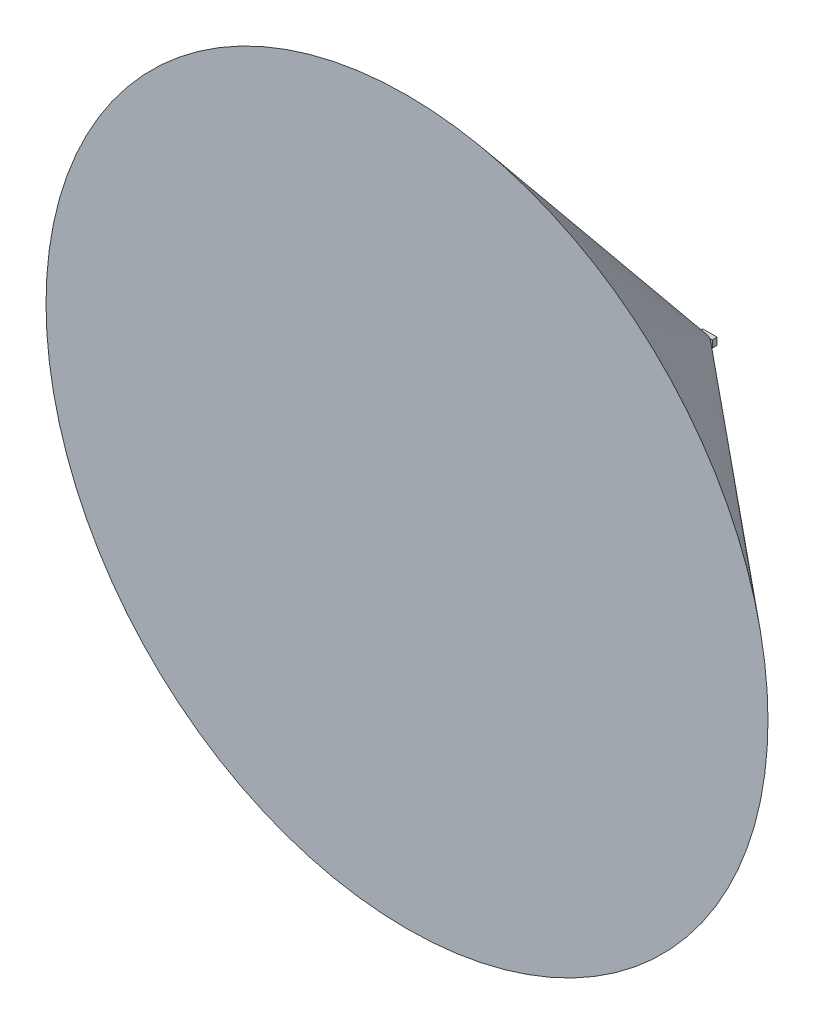
ISO-10303-21;
HEADER;
FILE_DESCRIPTION(('STEP AP214'),'2;1');
FILE_NAME('part.step','',(''),(''),'','','');
FILE_SCHEMA(('AUTOMOTIVE_DESIGN { 1 0 10303 214 1 1 1 1 }'));
ENDSEC;
DATA;
#1=APPLICATION_CONTEXT('core data for automotive mechanical design processes');
#2=APPLICATION_PROTOCOL_DEFINITION('international standard','automotive_design',2000,#1);
#3=PRODUCT_CONTEXT('',#1,'mechanical');
#4=PRODUCT('Part','Part','',(#3));
#5=PRODUCT_RELATED_PRODUCT_CATEGORY('part','',(#4));
#6=PRODUCT_DEFINITION_FORMATION('','',#4);
#7=PRODUCT_DEFINITION_CONTEXT('part definition',#1,'design');
#8=PRODUCT_DEFINITION('design','',#6,#7);
#9=PRODUCT_DEFINITION_SHAPE('','',#8);
#10=(LENGTH_UNIT() NAMED_UNIT(*) SI_UNIT(.MILLI.,.METRE.));
#11=(NAMED_UNIT(*) PLANE_ANGLE_UNIT() SI_UNIT($,.RADIAN.));
#12=(NAMED_UNIT(*) SI_UNIT($,.STERADIAN.) SOLID_ANGLE_UNIT());
#13=UNCERTAINTY_MEASURE_WITH_UNIT(LENGTH_MEASURE(1.E-05),#10,'distance_accuracy_value','');
#14=(GEOMETRIC_REPRESENTATION_CONTEXT(3) GLOBAL_UNCERTAINTY_ASSIGNED_CONTEXT((#13)) GLOBAL_UNIT_ASSIGNED_CONTEXT((#10,
#11,#12)) REPRESENTATION_CONTEXT('',''));
#15=CARTESIAN_POINT('',(0.,0.,0.));
#16=DIRECTION('',(0.,0.,1.));
#17=DIRECTION('',(1.,0.,0.));
#18=AXIS2_PLACEMENT_3D('',#15,#16,#17);
#19=CARTESIAN_POINT('',(19.05,-9.525,12.7));
#20=DIRECTION('',(0.,1.,0.));
#21=DIRECTION('',(-1.,0.,0.));
#22=AXIS2_PLACEMENT_3D('',#19,#20,#21);
#23=PLANE('',#22);
#24=CARTESIAN_POINT('',(-59.2111262841384,-9.52500000000001,50.3227791185919));
#25=CARTESIAN_POINT('',(-57.798130678007,-9.52500000000001,49.1522157168783));
#26=CARTESIAN_POINT('',(-56.3846450170607,-9.52500000000001,47.9822430952561));
#27=CARTESIAN_POINT('',(-53.554458063512,-9.52500000000001,45.6422846138725));
#28=CARTESIAN_POINT('',(-52.1377550091073,-9.52500000000001,44.4723008852144));
#29=CARTESIAN_POINT('',(-49.2738644169754,-9.52500000000001,42.1104987136385));
#30=CARTESIAN_POINT('',(-47.8266435009187,-9.52500000000001,40.9187207281784));
#31=CARTESIAN_POINT('',(-45.6551332887978,-9.52500000000001,39.1338628430146));
#32=CARTESIAN_POINT('',(-44.9316705583681,-9.52500000000001,38.539777296888));
#33=CARTESIAN_POINT('',(-43.4841379845895,-9.52500000000001,37.3524017893801));
#34=CARTESIAN_POINT('',(-42.7600681650686,-9.52500000000001,36.7591117989501));
#35=CARTESIAN_POINT('',(-40.5435245475182,-9.52500000000001,34.9451887422533));
#36=CARTESIAN_POINT('',(-39.0498701214968,-9.52500000000001,33.7259975383783));
#37=CARTESIAN_POINT('',(-36.0580297304135,-9.52500000000001,31.2925789464464));
#38=CARTESIAN_POINT('',(-34.5598429315699,-9.52500000000001,30.0783525822455));
#39=CARTESIAN_POINT('',(-32.303620111569,-9.52500000000001,28.259179818605));
#40=CARTESIAN_POINT('',(-31.5478663411044,-9.52500000000001,27.6514032175941));
#41=CARTESIAN_POINT('',(-30.0344594724018,-9.52500000000001,26.4382200679828));
#42=CARTESIAN_POINT('',(-29.276806376462,-9.52500000000001,25.832813516517));
#43=CARTESIAN_POINT('',(-27.759744700454,-9.52500000000001,24.6254132536541));
#44=CARTESIAN_POINT('',(-27.0003379395113,-9.52500000000001,24.0234172579237));
#45=CARTESIAN_POINT('',(-25.4785980523313,-9.52500000000001,22.8231568662502));
#46=CARTESIAN_POINT('',(-24.7162649717377,-9.525,22.2248924124827));
#47=CARTESIAN_POINT('',(-23.2044125998305,-9.525,21.0460835992658));
#48=CARTESIAN_POINT('',(-22.4549737260954,-9.525,20.4654362280629));
#49=CARTESIAN_POINT('',(-20.9514008626868,-9.525,19.310150864306));
#50=CARTESIAN_POINT('',(-20.197266589686,-9.525,18.7355132401066));
#51=CARTESIAN_POINT('',(-18.6805453964913,-9.525,17.5926243897406));
#52=CARTESIAN_POINT('',(-17.9179397188471,-9.525,17.0243979676637));
#53=CARTESIAN_POINT('',(-16.7677963738534,-9.525,16.1807105222463));
#54=CARTESIAN_POINT('',(-16.3834130169176,-9.525,15.9009496310058));
#55=CARTESIAN_POINT('',(-15.6121570128928,-9.525,15.3448831224064));
#56=CARTESIAN_POINT('',(-15.2252843882852,-9.525,15.0685774739082));
#57=CARTESIAN_POINT('',(-14.4532735749699,-9.525,14.5234496528037));
#58=CARTESIAN_POINT('',(-14.0681707875577,-9.525,14.2545774109422));
#59=CARTESIAN_POINT('',(-13.2945243302776,-9.525,13.7218094555373));
#60=CARTESIAN_POINT('',(-12.9059806151461,-9.525,13.4579138076018));
#61=CARTESIAN_POINT('',(-12.1244102603387,-9.525,12.936044349118));
#62=CARTESIAN_POINT('',(-11.7313798278556,-9.525,12.6780762055666));
#63=CARTESIAN_POINT('',(-10.9403408818977,-9.525,12.1698928702862));
#64=CARTESIAN_POINT('',(-10.5423325377767,-9.525,11.9196774158041));
#65=CARTESIAN_POINT('',(-9.74238255307357,-9.525,11.4304038828352));
#66=CARTESIAN_POINT('',(-9.34047285073558,-9.525,11.191293790989));
#67=CARTESIAN_POINT('',(-8.52930843774018,-9.525,10.7256220808828));
#68=CARTESIAN_POINT('',(-8.12005247764364,-9.525,10.4990626245076));
#69=CARTESIAN_POINT('',(-7.29348543299187,-9.525,10.0628106152164));
#70=CARTESIAN_POINT('',(-6.87618915562599,-9.525,9.85309016140765));
#71=CARTESIAN_POINT('',(-6.03138874872098,-9.525,9.4554669377871));
#72=CARTESIAN_POINT('',(-5.60388990947327,-9.525,9.26755314478225));
#73=CARTESIAN_POINT('',(-5.07873069318713,-9.525,9.05732703317884));
#74=CARTESIAN_POINT('',(-4.98655392643024,-9.525,9.02118323941209));
#75=CARTESIAN_POINT('',(-4.80165129108654,-9.525,8.95027532813555));
#76=CARTESIAN_POINT('',(-4.70892533077992,-9.525,8.9155114490027));
#77=CARTESIAN_POINT('',(-4.52290903820565,-9.525,8.84744225026026));
#78=CARTESIAN_POINT('',(-4.42961855205957,-9.525,8.81413735079453));
#79=CARTESIAN_POINT('',(-4.24250097578107,-9.525,8.7490850134668));
#80=CARTESIAN_POINT('',(-4.14867390588516,-9.525,8.71733751729641));
#81=CARTESIAN_POINT('',(-3.86645903140114,-9.525,8.62458799987588));
#82=CARTESIAN_POINT('',(-3.67725294046468,-9.525,8.5660478229745));
#83=CARTESIAN_POINT('',(-3.296730632139,-9.525,8.45628200069581));
#84=CARTESIAN_POINT('',(-3.10541446817722,-9.525,8.4050561705738));
#85=CARTESIAN_POINT('',(-2.72536288584043,-9.525,8.31178912034752));
#86=CARTESIAN_POINT('',(-2.53667414628418,-9.525,8.26955860093942));
#87=CARTESIAN_POINT('',(-2.15761527585595,-9.525,8.19345755027757));
#88=CARTESIAN_POINT('',(-1.96724519352046,-9.525,8.15958677850893));
#89=CARTESIAN_POINT('',(-1.58502886432571,-9.525,8.10079476350435));
#90=CARTESIAN_POINT('',(-1.39318196804172,-9.525,8.07587771797159));
#91=CARTESIAN_POINT('',(-1.00849586805919,-9.525,8.03550289220054));
#92=CARTESIAN_POINT('',(-0.815656695492749,-9.525,8.02004481699524));
#93=CARTESIAN_POINT('',(-0.425792895339982,-9.525,7.99870963764979));
#94=CARTESIAN_POINT('',(-0.228757974169955,-9.525,7.9930188976519));
#95=CARTESIAN_POINT('',(0.165339012858012,-9.525,7.99191765422109));
#96=CARTESIAN_POINT('',(0.362401078633483,-9.525,7.99650712021564));
#97=CARTESIAN_POINT('',(0.755961435402333,-9.525,8.0158628566554));
#98=CARTESIAN_POINT('',(0.95245988703034,-9.525,8.03062586060924));
#99=CARTESIAN_POINT('',(1.3444765098343,-9.525,8.06999758890299));
#100=CARTESIAN_POINT('',(1.53999454166912,-9.525,8.09460767471827));
#101=CARTESIAN_POINT('',(2.12722465693156,-9.525,8.18291984620323));
#102=CARTESIAN_POINT('',(2.51684205529649,-9.525,8.26095697978292));
#103=CARTESIAN_POINT('',(3.28800819008389,-9.525,8.44953439108731));
#104=CARTESIAN_POINT('',(3.66955439909583,-9.525,8.56008469308728));
#105=CARTESIAN_POINT('',(4.47202634358249,-9.525,8.82337552675518));
#106=CARTESIAN_POINT('',(4.89176310694337,-9.525,8.97969995311876));
#107=CARTESIAN_POINT('',(5.72076675296057,-9.525,9.31821942028616));
#108=CARTESIAN_POINT('',(6.13002756609517,-9.525,9.50042907514941));
#109=CARTESIAN_POINT('',(6.93991919741196,-9.525,9.88487926812466));
#110=CARTESIAN_POINT('',(7.3405316021264,-9.525,10.087158227942));
#111=CARTESIAN_POINT('',(8.13364149636261,-9.525,10.5067560519127));
#112=CARTESIAN_POINT('',(8.52614050828218,-9.525,10.7240720606243));
#113=CARTESIAN_POINT('',(9.30793126433211,-9.525,11.1723547678221));
#114=CARTESIAN_POINT('',(9.69716232331918,-9.525,11.4034267458107));
#115=CARTESIAN_POINT('',(10.4699688843146,-9.525,11.8748316239032));
#116=CARTESIAN_POINT('',(10.8535442010776,-9.525,12.1151648264173));
#117=CARTESIAN_POINT('',(11.6154939051243,-9.525,12.6028385447178));
#118=CARTESIAN_POINT('',(11.9938744475744,-9.525,12.8501694681199));
#119=CARTESIAN_POINT('',(12.5585021816909,-9.525,13.2255642782722));
#120=CARTESIAN_POINT('',(12.7462187114276,-9.525,13.3514274386007));
#121=CARTESIAN_POINT('',(13.1207547052055,-9.525,13.6044808984173));
#122=CARTESIAN_POINT('',(13.3075741711645,-9.525,13.7316711950662));
#123=CARTESIAN_POINT('',(13.9260010906962,-9.525,14.1556119993781));
#124=CARTESIAN_POINT('',(14.3558213404271,-9.525,14.4549716878554));
#125=CARTESIAN_POINT('',(15.2118601648683,-9.525,15.058803222371));
#126=CARTESIAN_POINT('',(15.6380786579664,-9.525,15.3632751837839));
#127=CARTESIAN_POINT('',(16.4875569269843,-9.525,15.9763823118836));
#128=CARTESIAN_POINT('',(16.910816476432,-9.525,16.2850177920549));
#129=CARTESIAN_POINT('',(17.7548338132205,-9.525,16.9056931194831));
#130=CARTESIAN_POINT('',(18.1755915811001,-9.525,17.217732993169));
#131=CARTESIAN_POINT('',(19.4349405602011,-9.525,18.1582267465879));
#132=CARTESIAN_POINT('',(20.2703852589862,-9.525,18.7908934104401));
#133=CARTESIAN_POINT('',(21.9352014108484,-9.525,20.0641678937604));
#134=CARTESIAN_POINT('',(22.7645727754719,-9.525,20.704775828523));
#135=CARTESIAN_POINT('',(24.0056774808653,-9.525,21.6704579600574));
#136=CARTESIAN_POINT('',(24.41912385122,-9.525,21.9933340530478));
#137=CARTESIAN_POINT('',(25.2450084522166,-9.525,22.6403664502462));
#138=CARTESIAN_POINT('',(25.6574466906518,-9.525,22.964522744507));
#139=CARTESIAN_POINT('',(26.8934564979113,-9.525,23.9386678898217));
#140=CARTESIAN_POINT('',(27.71571316439,-9.525,24.5903252136408));
#141=CARTESIAN_POINT('',(29.3573477342712,-9.525,25.896959975562));
#142=CARTESIAN_POINT('',(30.1767261136396,-9.525,26.5519368162951));
#143=CARTESIAN_POINT('',(31.8133051143811,-9.525,27.8646056882598));
#144=CARTESIAN_POINT('',(32.6305057343293,-9.525,28.522297721267));
#145=CARTESIAN_POINT('',(34.2585151114168,-9.525,29.836123126818));
#146=CARTESIAN_POINT('',(35.0693338254447,-9.525,30.4922441664984));
#147=CARTESIAN_POINT('',(36.68954208455,-9.525,31.8062487966064));
#148=CARTESIAN_POINT('',(37.4989316288521,-9.525,32.4641323879898));
#149=CARTESIAN_POINT('',(39.925401745075,-9.52499999999999,34.4400076036152));
#150=CARTESIAN_POINT('',(41.5407156998627,-9.525,35.7601686189558));
#151=CARTESIAN_POINT('',(44.7672882324955,-9.525,38.4039647057314));
#152=CARTESIAN_POINT('',(46.378548300614,-9.525,39.7275979599945));
#153=CARTESIAN_POINT('',(49.59859401347,-9.525,42.3778372226207));
#154=CARTESIAN_POINT('',(51.2073796830087,-9.52499999999999,43.7044432008562));
#155=CARTESIAN_POINT('',(53.3482438583699,-9.52499999999999,45.4723248848185));
#156=CARTESIAN_POINT('',(53.8811513191466,-9.52499999999999,45.9125973076647));
#157=CARTESIAN_POINT('',(54.9468057128318,-9.52499999999999,46.793394497836));
#158=CARTESIAN_POINT('',(55.4795526356174,-9.52499999999999,47.2339192774102));
#159=CARTESIAN_POINT('',(56.5455442469471,-9.52499999999999,48.1157333198826));
#160=CARTESIAN_POINT('',(57.0787887171165,-9.52499999999999,48.5570228467465));
#161=CARTESIAN_POINT('',(58.145088690378,-9.52499999999999,49.4397717532929));
#162=CARTESIAN_POINT('',(58.6781442020947,-9.52499999999999,49.8812311225574));
#163=CARTESIAN_POINT('',(59.2111262841384,-9.52499999999999,50.3227791185919));
#164=B_SPLINE_CURVE_WITH_KNOTS('',3,(#24,#25,#26,#27,#28,#29,#30,#31,#32,#33,#34,#35,#36,#37,
#38,#39,#40,#41,#42,#43,#44,#45,#46,#47,#48,#49,#50,#51,#52,#53,#54,#55,#56,#57,#58,#59,#60,#61,
#62,#63,#64,#65,#66,#67,#68,#69,#70,#71,#72,#73,#74,#75,#76,#77,#78,#79,#80,#81,#82,#83,#84,#85,
#86,#87,#88,#89,#90,#91,#92,#93,#94,#95,#96,#97,#98,#99,#100,#101,#102,#103,#104,#105,#106,#107,
#108,#109,#110,#111,#112,#113,#114,#115,#116,#117,#118,#119,#120,#121,#122,#123,#124,#125,#126,
#127,#128,#129,#130,#131,#132,#133,#134,#135,#136,#137,#138,#139,#140,#141,#142,#143,#144,#145,
#146,#147,#148,#149,#150,#151,#152,#153,#154,#155,#156,#157,#158,#159,#160,#161,#162,#163),
.UNSPECIFIED.,.F.,.F.,(4,2,2,2,2,2,2,2,2,2,2,2,2,2,2,2,2,2,2,2,2,2,2,2,2,2,2,2,2,2,2,2,2,2,2,2,
2,2,2,2,2,2,2,2,2,2,2,2,2,2,2,2,2,2,2,2,2,2,2,2,2,2,2,2,2,2,2,2,2,4),(0.,5.50463288732469,
11.0167261942872,16.6410498544287,19.4494339150643,22.257712475265,28.0418969300579,
33.8272194547593,36.7366840584958,39.6461451436184,42.553347862425,45.4605054184399,
48.3046491718042,51.1489662411247,54.001952728554,55.4281743999486,56.8543832087093,
58.2633824721277,59.6724002978331,61.0827134402983,62.4929787322307,63.8957848982212,
65.2988319551983,66.6995041240066,68.0994651448253,68.3964870151909,68.6935599740297,
68.9907179263356,69.287864744695,69.881888028169,70.4758963052353,71.0557916604281,
71.6356703297429,72.2158205052931,72.7959525886115,73.3870355857547,73.9781168250657,
74.5690083700202,75.1599816409555,76.3502153648191,77.5408164401666,78.8833701506339,
80.2266848631984,81.5726228174155,82.9183058841497,84.2761036762021,85.6339458425559,
86.9900091701999,87.6680248037928,88.3460389872049,89.9173724190544,91.4887413608658,
93.0602292838488,94.6317294153324,97.7755533776241,100.919423036745,102.493168548294,
104.066901855614,107.214406484139,110.36136350056,113.508322575338,116.637424320717,
119.766527763252,126.024997351609,132.280668746854,138.536277026758,140.610034835427,
142.683903679822,144.760385035418,146.836754650979),.UNSPECIFIED.);
#165=CARTESIAN_POINT('',(-11.7622613438332,-9.525,12.7));
#166=VERTEX_POINT('',#165);
#167=CARTESIAN_POINT('',(11.7622613438332,-9.525,12.7));
#168=VERTEX_POINT('',#167);
#169=EDGE_CURVE('E123',#166,#168,#164,.T.);
#170=ORIENTED_EDGE('',*,*,#169,.F.);
#171=DIRECTION('',(1.,0.,0.));
#172=VECTOR('',#171,1.);
#173=CARTESIAN_POINT('',(19.05,-9.525,12.7));
#174=LINE('',#173,#172);
#175=CARTESIAN_POINT('',(-19.05,-9.525,12.7));
#176=VERTEX_POINT('',#175);
#177=EDGE_CURVE('E109',#176,#166,#174,.T.);
#178=ORIENTED_EDGE('',*,*,#177,.F.);
#179=DIRECTION('',(0.,0.,-1.));
#180=VECTOR('',#179,1.);
#181=CARTESIAN_POINT('',(-19.05,-9.525,12.7));
#182=LINE('',#181,#180);
#183=CARTESIAN_POINT('',(-19.05,-9.525,0.));
#184=VERTEX_POINT('',#183);
#185=EDGE_CURVE('E133',#176,#184,#182,.T.);
#186=ORIENTED_EDGE('',*,*,#185,.T.);
#187=DIRECTION('',(1.,0.,0.));
#188=VECTOR('',#187,1.);
#189=CARTESIAN_POINT('',(19.05,-9.525,0.));
#190=LINE('',#189,#188);
#191=CARTESIAN_POINT('',(19.05,-9.525,0.));
#192=VERTEX_POINT('',#191);
#193=EDGE_CURVE('E156',#184,#192,#190,.T.);
#194=ORIENTED_EDGE('',*,*,#193,.T.);
#195=DIRECTION('',(0.,0.,-1.));
#196=VECTOR('',#195,1.);
#197=CARTESIAN_POINT('',(19.05,-9.525,12.7));
#198=LINE('',#197,#196);
#199=CARTESIAN_POINT('',(19.05,-9.525,12.7));
#200=VERTEX_POINT('',#199);
#201=EDGE_CURVE('E135',#200,#192,#198,.T.);
#202=ORIENTED_EDGE('',*,*,#201,.F.);
#203=EDGE_CURVE('E119',#168,#200,#174,.T.);
#204=ORIENTED_EDGE('',*,*,#203,.F.);
#205=EDGE_LOOP('',(#170,#178,#186,#194,#202,#204));
#206=FACE_BOUND('',#205,.T.);
#207=ADVANCED_FACE('F45',(#206),#23,.F.);
#208=CARTESIAN_POINT('',(19.05,9.525,12.7));
#209=DIRECTION('',(0.,-1.,0.));
#210=DIRECTION('',(1.,0.,0.));
#211=AXIS2_PLACEMENT_3D('',#208,#209,#210);
#212=PLANE('',#211);
#213=CARTESIAN_POINT('',(59.2111262841384,9.52500000000001,50.3227791185919));
#214=CARTESIAN_POINT('',(57.798130678007,9.52500000000001,49.1522157168783));
#215=CARTESIAN_POINT('',(56.3846450170607,9.52500000000001,47.9822430952561));
#216=CARTESIAN_POINT('',(53.554458063512,9.52500000000001,45.6422846138725));
#217=CARTESIAN_POINT('',(52.1377550091073,9.52500000000001,44.4723008852144));
#218=CARTESIAN_POINT('',(49.2738644169754,9.52500000000001,42.1104987136385));
#219=CARTESIAN_POINT('',(47.8266435009187,9.52500000000001,40.9187207281785));
#220=CARTESIAN_POINT('',(45.6551332887978,9.52500000000001,39.1338628430146));
#221=CARTESIAN_POINT('',(44.9316705583681,9.52500000000001,38.539777296888));
#222=CARTESIAN_POINT('',(43.4841379845896,9.52500000000001,37.3524017893802));
#223=CARTESIAN_POINT('',(42.7600681650687,9.52500000000001,36.7591117989501));
#224=CARTESIAN_POINT('',(40.5435245475183,9.52500000000001,34.9451887422533));
#225=CARTESIAN_POINT('',(39.0498701214969,9.525,33.7259975383784));
#226=CARTESIAN_POINT('',(36.0580297304136,9.525,31.2925789464464));
#227=CARTESIAN_POINT('',(34.5598429315699,9.525,30.0783525822455));
#228=CARTESIAN_POINT('',(32.3036201115691,9.525,28.259179818605));
#229=CARTESIAN_POINT('',(31.5478663411045,9.525,27.6514032175942));
#230=CARTESIAN_POINT('',(30.0344594724019,9.525,26.4382200679828));
#231=CARTESIAN_POINT('',(29.2768063764621,9.525,25.832813516517));
#232=CARTESIAN_POINT('',(27.759744700454,9.525,24.6254132536542));
#233=CARTESIAN_POINT('',(27.0003379395113,9.525,24.0234172579238));
#234=CARTESIAN_POINT('',(25.4785980523313,9.525,22.8231568662502));
#235=CARTESIAN_POINT('',(24.7162649717378,9.525,22.2248924124828));
#236=CARTESIAN_POINT('',(23.2044125998306,9.525,21.0460835992658));
#237=CARTESIAN_POINT('',(22.4549737260955,9.525,20.4654362280629));
#238=CARTESIAN_POINT('',(20.9514008626868,9.525,19.310150864306));
#239=CARTESIAN_POINT('',(20.1972665896861,9.525,18.7355132401067));
#240=CARTESIAN_POINT('',(18.6805453964913,9.525,17.5926243897407));
#241=CARTESIAN_POINT('',(17.9179397188471,9.525,17.0243979676637));
#242=CARTESIAN_POINT('',(16.7677963738534,9.525,16.1807105222463));
#243=CARTESIAN_POINT('',(16.3834130169176,9.525,15.9009496310059));
#244=CARTESIAN_POINT('',(15.6121570128928,9.525,15.3448831224065));
#245=CARTESIAN_POINT('',(15.2252843882852,9.525,15.0685774739082));
#246=CARTESIAN_POINT('',(14.4532735749699,9.525,14.5234496528037));
#247=CARTESIAN_POINT('',(14.0681707875577,9.525,14.2545774109422));
#248=CARTESIAN_POINT('',(13.2945243302776,9.525,13.7218094555373));
#249=CARTESIAN_POINT('',(12.9059806151461,9.525,13.4579138076018));
#250=CARTESIAN_POINT('',(12.1244102603387,9.525,12.936044349118));
#251=CARTESIAN_POINT('',(11.7313798278556,9.525,12.6780762055667));
#252=CARTESIAN_POINT('',(10.9403408818977,9.525,12.1698928702862));
#253=CARTESIAN_POINT('',(10.5423325377767,9.525,11.9196774158041));
#254=CARTESIAN_POINT('',(9.74238255307359,9.525,11.4304038828352));
#255=CARTESIAN_POINT('',(9.34047285073561,9.525,11.191293790989));
#256=CARTESIAN_POINT('',(8.5293084377402,9.525,10.7256220808828));
#257=CARTESIAN_POINT('',(8.12005247764365,9.525,10.4990626245076));
#258=CARTESIAN_POINT('',(7.29348543299189,9.525,10.0628106152164));
#259=CARTESIAN_POINT('',(6.87618915562601,9.525,9.85309016140766));
#260=CARTESIAN_POINT('',(6.03138874872099,9.525,9.45546693778711));
#261=CARTESIAN_POINT('',(5.60388990947329,9.525,9.26755314478226));
#262=CARTESIAN_POINT('',(5.07873069318715,9.525,9.05732703317885));
#263=CARTESIAN_POINT('',(4.98655392643026,9.525,9.02118323941209));
#264=CARTESIAN_POINT('',(4.80165129108656,9.525,8.95027532813556));
#265=CARTESIAN_POINT('',(4.70892533077994,9.525,8.91551144900271));
#266=CARTESIAN_POINT('',(4.52290903820567,9.525,8.84744225026026));
#267=CARTESIAN_POINT('',(4.42961855205958,9.525,8.81413735079453));
#268=CARTESIAN_POINT('',(4.24250097578109,9.525,8.7490850134668));
#269=CARTESIAN_POINT('',(4.14867390588518,9.525,8.71733751729642));
#270=CARTESIAN_POINT('',(3.86645903140115,9.525,8.62458799987588));
#271=CARTESIAN_POINT('',(3.6772529404647,9.525,8.5660478229745));
#272=CARTESIAN_POINT('',(3.29673063213902,9.525,8.45628200069581));
#273=CARTESIAN_POINT('',(3.10541446817724,9.525,8.40505617057381));
#274=CARTESIAN_POINT('',(2.72536288584044,9.525,8.31178912034753));
#275=CARTESIAN_POINT('',(2.5366741462842,9.525,8.26955860093942));
#276=CARTESIAN_POINT('',(2.15761527585597,9.525,8.19345755027757));
#277=CARTESIAN_POINT('',(1.96724519352047,9.525,8.15958677850893));
#278=CARTESIAN_POINT('',(1.58502886432572,9.525,8.10079476350435));
#279=CARTESIAN_POINT('',(1.39318196804174,9.525,8.07587771797159));
#280=CARTESIAN_POINT('',(1.00849586805921,9.525,8.03550289220054));
#281=CARTESIAN_POINT('',(0.815656695492771,9.525,8.02004481699524));
#282=CARTESIAN_POINT('',(0.425792895340004,9.525,7.99870963764979));
#283=CARTESIAN_POINT('',(0.228757974169976,9.525,7.9930188976519));
#284=CARTESIAN_POINT('',(-0.165339012857993,9.525,7.99191765422108));
#285=CARTESIAN_POINT('',(-0.362401078633465,9.525,7.99650712021563));
#286=CARTESIAN_POINT('',(-0.75596143540231,9.525,8.0158628566554));
#287=CARTESIAN_POINT('',(-0.952459887030311,9.525,8.03062586060924));
#288=CARTESIAN_POINT('',(-1.34447650983427,9.525,8.06999758890299));
#289=CARTESIAN_POINT('',(-1.53999454166909,9.525,8.09460767471826));
#290=CARTESIAN_POINT('',(-2.12722465693153,9.525,8.18291984620323));
#291=CARTESIAN_POINT('',(-2.51684205529646,9.525,8.26095697978291));
#292=CARTESIAN_POINT('',(-3.28800819008386,9.525,8.4495343910873));
#293=CARTESIAN_POINT('',(-3.66955439909581,9.525,8.56008469308727));
#294=CARTESIAN_POINT('',(-4.47202634358246,9.525,8.82337552675517));
#295=CARTESIAN_POINT('',(-4.89176310694334,9.525,8.97969995311875));
#296=CARTESIAN_POINT('',(-5.72076675296053,9.525,9.31821942028614));
#297=CARTESIAN_POINT('',(-6.13002756609513,9.525,9.50042907514939));
#298=CARTESIAN_POINT('',(-6.93991919741191,9.525,9.88487926812463));
#299=CARTESIAN_POINT('',(-7.34053160212635,9.525,10.087158227942));
#300=CARTESIAN_POINT('',(-8.13364149636254,9.525,10.5067560519126));
#301=CARTESIAN_POINT('',(-8.52614050828212,9.525,10.7240720606243));
#302=CARTESIAN_POINT('',(-9.30793126433204,9.525,11.1723547678221));
#303=CARTESIAN_POINT('',(-9.69716232331911,9.525,11.4034267458107));
#304=CARTESIAN_POINT('',(-10.4699688843146,9.525,11.8748316239032));
#305=CARTESIAN_POINT('',(-10.8535442010775,9.525,12.1151648264172));
#306=CARTESIAN_POINT('',(-11.6154939051242,9.525,12.6028385447178));
#307=CARTESIAN_POINT('',(-11.9938744475744,9.525,12.8501694681198));
#308=CARTESIAN_POINT('',(-12.5585021816908,9.525,13.2255642782721));
#309=CARTESIAN_POINT('',(-12.7462187114275,9.525,13.3514274386007));
#310=CARTESIAN_POINT('',(-13.1207547052054,9.525,13.6044808984172));
#311=CARTESIAN_POINT('',(-13.3075741711644,9.525,13.7316711950661));
#312=CARTESIAN_POINT('',(-13.9260010906961,9.525,14.1556119993781));
#313=CARTESIAN_POINT('',(-14.355821340427,9.525,14.4549716878554));
#314=CARTESIAN_POINT('',(-15.2118601648682,9.525,15.0588032223709));
#315=CARTESIAN_POINT('',(-15.6380786579662,9.525,15.3632751837839));
#316=CARTESIAN_POINT('',(-16.4875569269842,9.525,15.9763823118835));
#317=CARTESIAN_POINT('',(-16.9108164764319,9.525,16.2850177920548));
#318=CARTESIAN_POINT('',(-17.7548338132203,9.525,16.905693119483));
#319=CARTESIAN_POINT('',(-18.1755915810999,9.525,17.2177329931689));
#320=CARTESIAN_POINT('',(-19.4349405602009,9.525,18.1582267465878));
#321=CARTESIAN_POINT('',(-20.270385258986,9.525,18.79089341044));
#322=CARTESIAN_POINT('',(-21.9352014108482,9.525,20.0641678937603));
#323=CARTESIAN_POINT('',(-22.7645727754717,9.525,20.7047758285229));
#324=CARTESIAN_POINT('',(-24.0056774808651,9.525,21.6704579600572));
#325=CARTESIAN_POINT('',(-24.4191238512198,9.525,21.9933340530476));
#326=CARTESIAN_POINT('',(-25.2450084522164,9.525,22.6403664502461));
#327=CARTESIAN_POINT('',(-25.6574466906515,9.525,22.9645227445069));
#328=CARTESIAN_POINT('',(-26.8934564979111,9.52499999999999,23.9386678898215));
#329=CARTESIAN_POINT('',(-27.7157131643897,9.525,24.5903252136406));
#330=CARTESIAN_POINT('',(-29.3573477342709,9.525,25.8969599755618));
#331=CARTESIAN_POINT('',(-30.1767261136393,9.525,26.5519368162949));
#332=CARTESIAN_POINT('',(-31.8133051143808,9.525,27.8646056882596));
#333=CARTESIAN_POINT('',(-32.630505734329,9.525,28.5222977212668));
#334=CARTESIAN_POINT('',(-34.2585151114165,9.525,29.8361231268177));
#335=CARTESIAN_POINT('',(-35.0693338254444,9.525,30.4922441664982));
#336=CARTESIAN_POINT('',(-36.6895420845497,9.525,31.8062487966061));
#337=CARTESIAN_POINT('',(-37.4989316288518,9.52499999999999,32.4641323879895));
#338=CARTESIAN_POINT('',(-39.9254017450746,9.52499999999999,34.4400076036149));
#339=CARTESIAN_POINT('',(-41.5407156998623,9.52499999999999,35.7601686189555));
#340=CARTESIAN_POINT('',(-44.767288232495,9.52499999999999,38.4039647057311));
#341=CARTESIAN_POINT('',(-46.3785483006135,9.52499999999999,39.7275979599941));
#342=CARTESIAN_POINT('',(-49.5985940134695,9.52499999999999,42.3778372226203));
#343=CARTESIAN_POINT('',(-51.2073796830083,9.52499999999999,43.7044432008557));
#344=CARTESIAN_POINT('',(-53.3482438583694,9.52499999999999,45.4723248848181));
#345=CARTESIAN_POINT('',(-53.8811513191461,9.52499999999999,45.9125973076643));
#346=CARTESIAN_POINT('',(-54.9468057128314,9.52499999999999,46.7933944978357));
#347=CARTESIAN_POINT('',(-55.4795526356171,9.52499999999999,47.23391927741));
#348=CARTESIAN_POINT('',(-56.5455442469469,9.52499999999999,48.1157333198824));
#349=CARTESIAN_POINT('',(-57.0787887171163,9.52499999999999,48.5570228467463));
#350=CARTESIAN_POINT('',(-58.1450886903779,9.52499999999999,49.4397717532929));
#351=CARTESIAN_POINT('',(-58.6781442020946,9.52499999999999,49.8812311225574));
#352=CARTESIAN_POINT('',(-59.2111262841384,9.52499999999999,50.3227791185919));
#353=B_SPLINE_CURVE_WITH_KNOTS('',3,(#213,#214,#215,#216,#217,#218,#219,#220,#221,#222,#223,
#224,#225,#226,#227,#228,#229,#230,#231,#232,#233,#234,#235,#236,#237,#238,#239,#240,#241,#242,
#243,#244,#245,#246,#247,#248,#249,#250,#251,#252,#253,#254,#255,#256,#257,#258,#259,#260,#261,
#262,#263,#264,#265,#266,#267,#268,#269,#270,#271,#272,#273,#274,#275,#276,#277,#278,#279,#280,
#281,#282,#283,#284,#285,#286,#287,#288,#289,#290,#291,#292,#293,#294,#295,#296,#297,#298,#299,
#300,#301,#302,#303,#304,#305,#306,#307,#308,#309,#310,#311,#312,#313,#314,#315,#316,#317,#318,
#319,#320,#321,#322,#323,#324,#325,#326,#327,#328,#329,#330,#331,#332,#333,#334,#335,#336,#337,
#338,#339,#340,#341,#342,#343,#344,#345,#346,#347,#348,#349,#350,#351,#352),.UNSPECIFIED.,.F.,
.F.,(4,2,2,2,2,2,2,2,2,2,2,2,2,2,2,2,2,2,2,2,2,2,2,2,2,2,2,2,2,2,2,2,2,2,2,2,2,2,2,2,2,2,2,2,2,
2,2,2,2,2,2,2,2,2,2,2,2,2,2,2,2,2,2,2,2,2,2,2,2,4),(0.,5.50463288732465,11.0167261942872,
16.6410498544286,19.4494339150642,22.2577124752648,28.0418969300578,33.8272194547592,
36.7366840584957,39.6461451436183,42.5533478624249,45.4605054184398,48.3046491718041,
51.1489662411246,54.0019527285539,55.4281743999486,56.8543832087093,58.2633824721277,
59.672400297833,61.0827134402983,62.4929787322307,63.8957848982211,65.2988319551982,
66.6995041240065,68.0994651448252,68.3964870151908,68.6935599740296,68.9907179263356,
69.2878647446949,69.8818880281689,70.4758963052353,71.0557916604281,71.6356703297428,
72.215820505293,72.7959525886114,73.3870355857546,73.9781168250656,74.5690083700201,
75.1599816409554,76.3502153648191,77.5408164401666,78.8833701506338,80.2266848631983,
81.5726228174154,82.9183058841495,84.276103676202,85.6339458425557,86.9900091701998,
87.6680248037927,88.3460389872047,89.9173724190542,91.4887413608656,93.0602292838486,
94.6317294153322,97.7755533776239,100.919423036745,102.493168548294,104.066901855614,
107.214406484138,110.36136350056,113.508322575338,116.637424320717,119.766527763252,
126.024997351608,132.280668746853,138.536277026757,140.610034835426,142.683903679821,
144.760385035418,146.836754650979),.UNSPECIFIED.);
#354=CARTESIAN_POINT('',(11.7622613438332,9.525,12.7));
#355=VERTEX_POINT('',#354);
#356=CARTESIAN_POINT('',(-11.7622613438332,9.525,12.7));
#357=VERTEX_POINT('',#356);
#358=EDGE_CURVE('E128',#355,#357,#353,.T.);
#359=ORIENTED_EDGE('',*,*,#358,.F.);
#360=DIRECTION('',(-1.,0.,0.));
#361=VECTOR('',#360,1.);
#362=CARTESIAN_POINT('',(19.05,9.525,12.7));
#363=LINE('',#362,#361);
#364=CARTESIAN_POINT('',(19.05,9.525,12.7));
#365=VERTEX_POINT('',#364);
#366=EDGE_CURVE('E149',#365,#355,#363,.T.);
#367=ORIENTED_EDGE('',*,*,#366,.F.);
#368=DIRECTION('',(0.,0.,-1.));
#369=VECTOR('',#368,1.);
#370=CARTESIAN_POINT('',(19.05,9.525,12.7));
#371=LINE('',#370,#369);
#372=CARTESIAN_POINT('',(19.05,9.525,0.));
#373=VERTEX_POINT('',#372);
#374=EDGE_CURVE('E139',#365,#373,#371,.T.);
#375=ORIENTED_EDGE('',*,*,#374,.T.);
#376=DIRECTION('',(-1.,0.,0.));
#377=VECTOR('',#376,1.);
#378=CARTESIAN_POINT('',(19.05,9.525,0.));
#379=LINE('',#378,#377);
#380=CARTESIAN_POINT('',(-19.05,9.525,0.));
#381=VERTEX_POINT('',#380);
#382=EDGE_CURVE('E150',#373,#381,#379,.T.);
#383=ORIENTED_EDGE('',*,*,#382,.T.);
#384=DIRECTION('',(0.,0.,-1.));
#385=VECTOR('',#384,1.);
#386=CARTESIAN_POINT('',(-19.05,9.525,12.7));
#387=LINE('',#386,#385);
#388=CARTESIAN_POINT('',(-19.05,9.525,12.7));
#389=VERTEX_POINT('',#388);
#390=EDGE_CURVE('E145',#389,#381,#387,.T.);
#391=ORIENTED_EDGE('',*,*,#390,.F.);
#392=EDGE_CURVE('E164',#357,#389,#363,.T.);
#393=ORIENTED_EDGE('',*,*,#392,.F.);
#394=EDGE_LOOP('',(#359,#367,#375,#383,#391,#393));
#395=FACE_BOUND('',#394,.T.);
#396=ADVANCED_FACE('F197',(#395),#212,.F.);
#397=CARTESIAN_POINT('',(0.,0.,12.7));
#398=DIRECTION('',(0.,0.,-1.));
#399=DIRECTION('',(-1.,0.,0.));
#400=AXIS2_PLACEMENT_3D('',#397,#398,#399);
#401=PLANE('',#400);
#402=CARTESIAN_POINT('',(0.,0.,12.7));
#403=DIRECTION('',(0.,0.,-1.));
#404=DIRECTION('',(-1.,0.,0.));
#405=AXIS2_PLACEMENT_3D('',#402,#403,#404);
#406=CIRCLE('',#405,15.1352706259463);
#407=EDGE_CURVE('E11',#168,#355,#406,.F.);
#408=ORIENTED_EDGE('',*,*,#407,.F.);
#409=ORIENTED_EDGE('',*,*,#203,.T.);
#410=DIRECTION('',(0.,1.,0.));
#411=VECTOR('',#410,1.);
#412=CARTESIAN_POINT('',(19.05,9.525,12.7));
#413=LINE('',#412,#411);
#414=EDGE_CURVE('E118',#200,#365,#413,.T.);
#415=ORIENTED_EDGE('',*,*,#414,.T.);
#416=ORIENTED_EDGE('',*,*,#366,.T.);
#417=EDGE_LOOP('',(#408,#409,#415,#416));
#418=FACE_BOUND('',#417,.T.);
#419=ADVANCED_FACE('F195',(#418),#401,.F.);
#420=CARTESIAN_POINT('',(-19.05,9.525,12.7));
#421=DIRECTION('',(1.,0.,0.));
#422=DIRECTION('',(0.,1.,0.));
#423=AXIS2_PLACEMENT_3D('',#420,#421,#422);
#424=PLANE('',#423);
#425=DIRECTION('',(0.,-1.,0.));
#426=VECTOR('',#425,1.);
#427=CARTESIAN_POINT('',(-19.05,9.525,0.));
#428=LINE('',#427,#426);
#429=EDGE_CURVE('E127',#381,#184,#428,.T.);
#430=ORIENTED_EDGE('',*,*,#429,.T.);
#431=ORIENTED_EDGE('',*,*,#185,.F.);
#432=DIRECTION('',(0.,-1.,0.));
#433=VECTOR('',#432,1.);
#434=CARTESIAN_POINT('',(-19.05,9.525,12.7));
#435=LINE('',#434,#433);
#436=EDGE_CURVE('E113',#389,#176,#435,.T.);
#437=ORIENTED_EDGE('',*,*,#436,.F.);
#438=ORIENTED_EDGE('',*,*,#390,.T.);
#439=EDGE_LOOP('',(#430,#431,#437,#438));
#440=FACE_BOUND('',#439,.T.);
#441=ADVANCED_FACE('F47',(#440),#424,.F.);
#442=CARTESIAN_POINT('',(19.05,9.525,12.7));
#443=DIRECTION('',(-1.,0.,0.));
#444=DIRECTION('',(0.,-1.,0.));
#445=AXIS2_PLACEMENT_3D('',#442,#443,#444);
#446=PLANE('',#445);
#447=DIRECTION('',(0.,1.,0.));
#448=VECTOR('',#447,1.);
#449=CARTESIAN_POINT('',(19.05,9.525,0.));
#450=LINE('',#449,#448);
#451=EDGE_CURVE('E153',#192,#373,#450,.T.);
#452=ORIENTED_EDGE('',*,*,#451,.T.);
#453=ORIENTED_EDGE('',*,*,#374,.F.);
#454=ORIENTED_EDGE('',*,*,#414,.F.);
#455=ORIENTED_EDGE('',*,*,#201,.T.);
#456=EDGE_LOOP('',(#452,#453,#454,#455));
#457=FACE_BOUND('',#456,.T.);
#458=ADVANCED_FACE('F194',(#457),#446,.F.);
#459=EDGE_CURVE('E49',#357,#166,#406,.F.);
#460=ORIENTED_EDGE('',*,*,#459,.F.);
#461=ORIENTED_EDGE('',*,*,#392,.T.);
#462=ORIENTED_EDGE('',*,*,#436,.T.);
#463=ORIENTED_EDGE('',*,*,#177,.T.);
#464=EDGE_LOOP('',(#460,#461,#462,#463));
#465=FACE_BOUND('',#464,.T.);
#466=ADVANCED_FACE('F111',(#465),#401,.F.);
#467=CARTESIAN_POINT('',(0.,0.,0.));
#468=DIRECTION('',(0.,0.,-1.));
#469=DIRECTION('',(-1.,0.,0.));
#470=AXIS2_PLACEMENT_3D('',#467,#468,#469);
#471=PLANE('',#470);
#472=CARTESIAN_POINT('',(0.,0.,0.));
#473=VERTEX_POINT('',#472);
#474=VERTEX_LOOP('',#473);
#475=FACE_BOUND('',#474,.T.);
#476=ORIENTED_EDGE('',*,*,#429,.F.);
#477=ORIENTED_EDGE('',*,*,#382,.F.);
#478=ORIENTED_EDGE('',*,*,#451,.F.);
#479=ORIENTED_EDGE('',*,*,#193,.F.);
#480=EDGE_LOOP('',(#476,#477,#478,#479));
#481=FACE_BOUND('',#480,.T.);
#482=ADVANCED_FACE('F186',(#475,#481),#471,.T.);
#483=CARTESIAN_POINT('',(0.,0.,0.));
#484=DIRECTION('',(0.,0.,1.));
#485=DIRECTION('',(1.,0.,0.));
#486=AXIS2_PLACEMENT_3D('',#483,#484,#485);
#487=CONICAL_SURFACE('',#486,0.,0.872664625997159);
#488=CARTESIAN_POINT('',(0.,0.,800.));
#489=DIRECTION('',(0.,0.,1.));
#490=DIRECTION('',(1.,0.,0.));
#491=AXIS2_PLACEMENT_3D('',#488,#489,#490);
#492=CIRCLE('',#491,953.402874075358);
#493=CARTESIAN_POINT('',(953.402874075358,0.,800.));
#494=VERTEX_POINT('',#493);
#495=EDGE_CURVE('E273',#494,#494,#492,.T.);
#496=ORIENTED_EDGE('',*,*,#495,.F.);
#497=EDGE_LOOP('',(#496));
#498=FACE_BOUND('',#497,.T.);
#499=ORIENTED_EDGE('',*,*,#169,.T.);
#500=ORIENTED_EDGE('',*,*,#407,.T.);
#501=ORIENTED_EDGE('',*,*,#358,.T.);
#502=ORIENTED_EDGE('',*,*,#459,.T.);
#503=EDGE_LOOP('',(#499,#500,#501,#502));
#504=FACE_BOUND('',#503,.T.);
#505=ADVANCED_FACE('F131',(#498,#504),#487,.T.);
#506=CARTESIAN_POINT('',(0.,953.402874075358,800.));
#507=DIRECTION('',(0.,0.,-1.));
#508=DIRECTION('',(-1.,0.,0.));
#509=AXIS2_PLACEMENT_3D('',#506,#507,#508);
#510=PLANE('',#509);
#511=ORIENTED_EDGE('',*,*,#495,.T.);
#512=EDGE_LOOP('',(#511));
#513=FACE_BOUND('',#512,.T.);
#514=ADVANCED_FACE('F185',(#513),#510,.F.);
#515=CLOSED_SHELL('',(#207,#396,#419,#441,#458,#466,#482,#505,#514));
#516=MANIFOLD_SOLID_BREP('B2',#515);
#517=ADVANCED_BREP_SHAPE_REPRESENTATION('',(#18,#516),#14);
#518=SHAPE_DEFINITION_REPRESENTATION(#9,#517);
ENDSEC;
END-ISO-10303-21;
